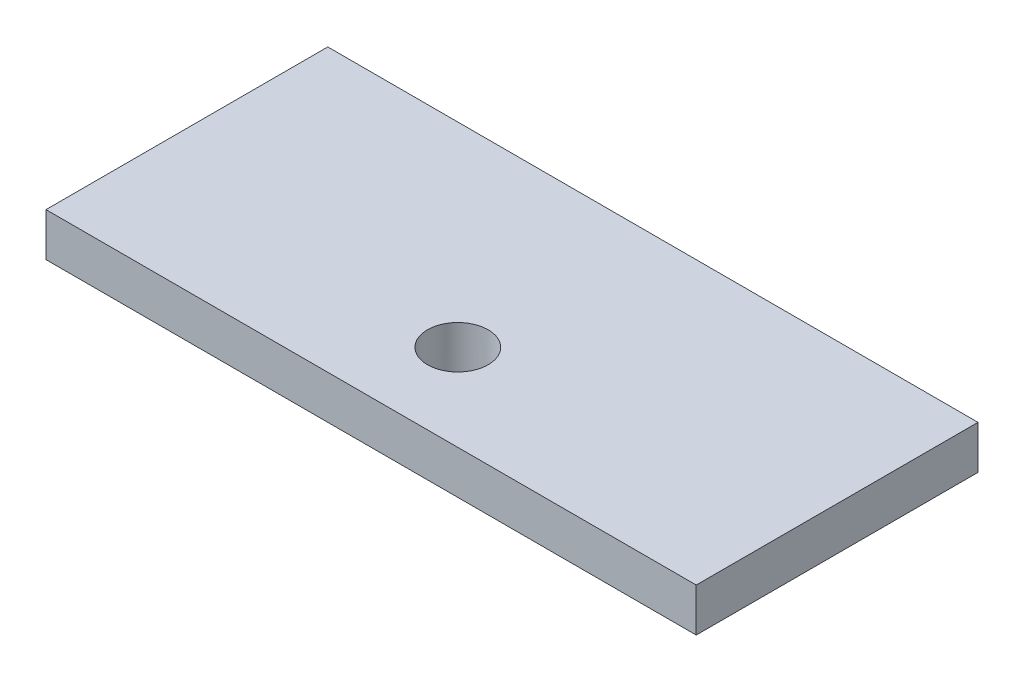
ISO-10303-21;
HEADER;
FILE_DESCRIPTION(('STEP AP214'),'2;1');
FILE_NAME('part.step','',(''),(''),'','','');
FILE_SCHEMA(('AUTOMOTIVE_DESIGN { 1 0 10303 214 1 1 1 1 }'));
ENDSEC;
DATA;
#1=APPLICATION_CONTEXT('core data for automotive mechanical design processes');
#2=APPLICATION_PROTOCOL_DEFINITION('international standard','automotive_design',2000,#1);
#3=PRODUCT_CONTEXT('',#1,'mechanical');
#4=PRODUCT('Part','Part','',(#3));
#5=PRODUCT_RELATED_PRODUCT_CATEGORY('part','',(#4));
#6=PRODUCT_DEFINITION_FORMATION('','',#4);
#7=PRODUCT_DEFINITION_CONTEXT('part definition',#1,'design');
#8=PRODUCT_DEFINITION('design','',#6,#7);
#9=PRODUCT_DEFINITION_SHAPE('','',#8);
#10=(LENGTH_UNIT() NAMED_UNIT(*) SI_UNIT(.MILLI.,.METRE.));
#11=(NAMED_UNIT(*) PLANE_ANGLE_UNIT() SI_UNIT($,.RADIAN.));
#12=(NAMED_UNIT(*) SI_UNIT($,.STERADIAN.) SOLID_ANGLE_UNIT());
#13=UNCERTAINTY_MEASURE_WITH_UNIT(LENGTH_MEASURE(1.E-05),#10,'distance_accuracy_value','');
#14=(GEOMETRIC_REPRESENTATION_CONTEXT(3) GLOBAL_UNCERTAINTY_ASSIGNED_CONTEXT((#13)) GLOBAL_UNIT_ASSIGNED_CONTEXT((#10,
#11,#12)) REPRESENTATION_CONTEXT('',''));
#15=CARTESIAN_POINT('',(0.,0.,0.));
#16=DIRECTION('',(0.,0.,1.));
#17=DIRECTION('',(1.,0.,0.));
#18=AXIS2_PLACEMENT_3D('',#15,#16,#17);
#19=CARTESIAN_POINT('',(75.,10.,32.5));
#20=DIRECTION('',(-1.,0.,0.));
#21=DIRECTION('',(0.,0.,1.));
#22=AXIS2_PLACEMENT_3D('',#19,#20,#21);
#23=PLANE('',#22);
#24=DIRECTION('',(0.,0.,-1.));
#25=VECTOR('',#24,1.);
#26=CARTESIAN_POINT('',(75.,0.,32.5));
#27=LINE('',#26,#25);
#28=CARTESIAN_POINT('',(75.,0.,32.5));
#29=VERTEX_POINT('',#28);
#30=CARTESIAN_POINT('',(75.,0.,-32.5));
#31=VERTEX_POINT('',#30);
#32=EDGE_CURVE('E100',#29,#31,#27,.T.);
#33=ORIENTED_EDGE('',*,*,#32,.T.);
#34=DIRECTION('',(0.,-1.,0.));
#35=VECTOR('',#34,1.);
#36=CARTESIAN_POINT('',(75.,10.,-32.5));
#37=LINE('',#36,#35);
#38=CARTESIAN_POINT('',(75.,10.,-32.5));
#39=VERTEX_POINT('',#38);
#40=EDGE_CURVE('E11',#39,#31,#37,.T.);
#41=ORIENTED_EDGE('',*,*,#40,.F.);
#42=DIRECTION('',(0.,0.,-1.));
#43=VECTOR('',#42,1.);
#44=CARTESIAN_POINT('',(75.,10.,32.5));
#45=LINE('',#44,#43);
#46=CARTESIAN_POINT('',(75.,10.,32.5));
#47=VERTEX_POINT('',#46);
#48=EDGE_CURVE('E87',#47,#39,#45,.T.);
#49=ORIENTED_EDGE('',*,*,#48,.F.);
#50=DIRECTION('',(0.,-1.,0.));
#51=VECTOR('',#50,1.);
#52=CARTESIAN_POINT('',(75.,10.,32.5));
#53=LINE('',#52,#51);
#54=EDGE_CURVE('E96',#47,#29,#53,.T.);
#55=ORIENTED_EDGE('',*,*,#54,.T.);
#56=EDGE_LOOP('',(#33,#41,#49,#55));
#57=FACE_BOUND('',#56,.T.);
#58=ADVANCED_FACE('F35',(#57),#23,.F.);
#59=CARTESIAN_POINT('',(-75.,10.,-32.5));
#60=DIRECTION('',(0.,0.,1.));
#61=DIRECTION('',(1.,0.,0.));
#62=AXIS2_PLACEMENT_3D('',#59,#60,#61);
#63=PLANE('',#62);
#64=DIRECTION('',(-1.,0.,0.));
#65=VECTOR('',#64,1.);
#66=CARTESIAN_POINT('',(-75.,0.,-32.5));
#67=LINE('',#66,#65);
#68=CARTESIAN_POINT('',(-75.,0.,-32.5));
#69=VERTEX_POINT('',#68);
#70=EDGE_CURVE('E91',#31,#69,#67,.T.);
#71=ORIENTED_EDGE('',*,*,#70,.T.);
#72=DIRECTION('',(0.,-1.,0.));
#73=VECTOR('',#72,1.);
#74=CARTESIAN_POINT('',(-75.,10.,-32.5));
#75=LINE('',#74,#73);
#76=CARTESIAN_POINT('',(-75.,10.,-32.5));
#77=VERTEX_POINT('',#76);
#78=EDGE_CURVE('E44',#77,#69,#75,.T.);
#79=ORIENTED_EDGE('',*,*,#78,.F.);
#80=DIRECTION('',(-1.,0.,0.));
#81=VECTOR('',#80,1.);
#82=CARTESIAN_POINT('',(-75.,10.,-32.5));
#83=LINE('',#82,#81);
#84=EDGE_CURVE('E82',#39,#77,#83,.T.);
#85=ORIENTED_EDGE('',*,*,#84,.F.);
#86=ORIENTED_EDGE('',*,*,#40,.T.);
#87=EDGE_LOOP('',(#71,#79,#85,#86));
#88=FACE_BOUND('',#87,.T.);
#89=ADVANCED_FACE('F90',(#88),#63,.F.);
#90=CARTESIAN_POINT('',(-75.,10.,32.5));
#91=DIRECTION('',(1.,0.,0.));
#92=DIRECTION('',(0.,0.,-1.));
#93=AXIS2_PLACEMENT_3D('',#90,#91,#92);
#94=PLANE('',#93);
#95=DIRECTION('',(0.,0.,1.));
#96=VECTOR('',#95,1.);
#97=CARTESIAN_POINT('',(-75.,0.,32.5));
#98=LINE('',#97,#96);
#99=CARTESIAN_POINT('',(-75.,0.,32.5));
#100=VERTEX_POINT('',#99);
#101=EDGE_CURVE('E69',#69,#100,#98,.T.);
#102=ORIENTED_EDGE('',*,*,#101,.T.);
#103=DIRECTION('',(0.,-1.,0.));
#104=VECTOR('',#103,1.);
#105=CARTESIAN_POINT('',(-75.,10.,32.5));
#106=LINE('',#105,#104);
#107=CARTESIAN_POINT('',(-75.,10.,32.5));
#108=VERTEX_POINT('',#107);
#109=EDGE_CURVE('E92',#108,#100,#106,.T.);
#110=ORIENTED_EDGE('',*,*,#109,.F.);
#111=DIRECTION('',(0.,0.,1.));
#112=VECTOR('',#111,1.);
#113=CARTESIAN_POINT('',(-75.,10.,32.5));
#114=LINE('',#113,#112);
#115=EDGE_CURVE('E85',#77,#108,#114,.T.);
#116=ORIENTED_EDGE('',*,*,#115,.F.);
#117=ORIENTED_EDGE('',*,*,#78,.T.);
#118=EDGE_LOOP('',(#102,#110,#116,#117));
#119=FACE_BOUND('',#118,.T.);
#120=ADVANCED_FACE('F94',(#119),#94,.F.);
#121=CARTESIAN_POINT('',(-75.,10.,32.5));
#122=DIRECTION('',(0.,0.,-1.));
#123=DIRECTION('',(-1.,0.,0.));
#124=AXIS2_PLACEMENT_3D('',#121,#122,#123);
#125=PLANE('',#124);
#126=DIRECTION('',(1.,0.,0.));
#127=VECTOR('',#126,1.);
#128=CARTESIAN_POINT('',(-75.,0.,32.5));
#129=LINE('',#128,#127);
#130=EDGE_CURVE('E75',#100,#29,#129,.T.);
#131=ORIENTED_EDGE('',*,*,#130,.T.);
#132=ORIENTED_EDGE('',*,*,#54,.F.);
#133=DIRECTION('',(1.,0.,0.));
#134=VECTOR('',#133,1.);
#135=CARTESIAN_POINT('',(-75.,10.,32.5));
#136=LINE('',#135,#134);
#137=EDGE_CURVE('E52',#108,#47,#136,.T.);
#138=ORIENTED_EDGE('',*,*,#137,.F.);
#139=ORIENTED_EDGE('',*,*,#109,.T.);
#140=EDGE_LOOP('',(#131,#132,#138,#139));
#141=FACE_BOUND('',#140,.T.);
#142=ADVANCED_FACE('F107',(#141),#125,.F.);
#143=CARTESIAN_POINT('',(0.,10.,0.));
#144=DIRECTION('',(0.,-1.,0.));
#145=DIRECTION('',(0.,0.,-1.));
#146=AXIS2_PLACEMENT_3D('',#143,#144,#145);
#147=PLANE('',#146);
#148=CARTESIAN_POINT('',(0.,10.,12.5));
#149=DIRECTION('',(0.,1.,0.));
#150=DIRECTION('',(0.,0.,1.));
#151=AXIS2_PLACEMENT_3D('',#148,#149,#150);
#152=CIRCLE('',#151,7.);
#153=CARTESIAN_POINT('',(0.,10.,19.5));
#154=VERTEX_POINT('',#153);
#155=EDGE_CURVE('E113',#154,#154,#152,.T.);
#156=ORIENTED_EDGE('',*,*,#155,.F.);
#157=EDGE_LOOP('',(#156));
#158=FACE_BOUND('',#157,.T.);
#159=ORIENTED_EDGE('',*,*,#48,.T.);
#160=ORIENTED_EDGE('',*,*,#84,.T.);
#161=ORIENTED_EDGE('',*,*,#115,.T.);
#162=ORIENTED_EDGE('',*,*,#137,.T.);
#163=EDGE_LOOP('',(#159,#160,#161,#162));
#164=FACE_BOUND('',#163,.T.);
#165=ADVANCED_FACE('F83',(#158,#164),#147,.F.);
#166=CARTESIAN_POINT('',(0.,0.,0.));
#167=DIRECTION('',(0.,-1.,0.));
#168=DIRECTION('',(0.,0.,-1.));
#169=AXIS2_PLACEMENT_3D('',#166,#167,#168);
#170=PLANE('',#169);
#171=CARTESIAN_POINT('',(0.,0.,12.5));
#172=DIRECTION('',(0.,-1.,0.));
#173=DIRECTION('',(0.,0.,-1.));
#174=AXIS2_PLACEMENT_3D('',#171,#172,#173);
#175=CIRCLE('',#174,7.);
#176=CARTESIAN_POINT('',(0.,0.,5.5));
#177=VERTEX_POINT('',#176);
#178=EDGE_CURVE('E38',#177,#177,#175,.T.);
#179=ORIENTED_EDGE('',*,*,#178,.F.);
#180=EDGE_LOOP('',(#179));
#181=FACE_BOUND('',#180,.T.);
#182=ORIENTED_EDGE('',*,*,#32,.F.);
#183=ORIENTED_EDGE('',*,*,#130,.F.);
#184=ORIENTED_EDGE('',*,*,#101,.F.);
#185=ORIENTED_EDGE('',*,*,#70,.F.);
#186=EDGE_LOOP('',(#182,#183,#184,#185));
#187=FACE_BOUND('',#186,.T.);
#188=ADVANCED_FACE('F110',(#181,#187),#170,.T.);
#189=CARTESIAN_POINT('',(0.,-1.2E-05,12.5));
#190=DIRECTION('',(0.,1.,0.));
#191=DIRECTION('',(0.,0.,1.));
#192=AXIS2_PLACEMENT_3D('',#189,#190,#191);
#193=CYLINDRICAL_SURFACE('',#192,7.);
#194=ORIENTED_EDGE('',*,*,#178,.T.);
#195=EDGE_LOOP('',(#194));
#196=FACE_BOUND('',#195,.T.);
#197=ORIENTED_EDGE('',*,*,#155,.T.);
#198=EDGE_LOOP('',(#197));
#199=FACE_BOUND('',#198,.T.);
#200=ADVANCED_FACE('F120',(#196,#199),#193,.F.);
#201=CLOSED_SHELL('',(#58,#89,#120,#142,#165,#188,#200));
#202=MANIFOLD_SOLID_BREP('B2',#201);
#203=ADVANCED_BREP_SHAPE_REPRESENTATION('',(#18,#202),#14);
#204=SHAPE_DEFINITION_REPRESENTATION(#9,#203);
ENDSEC;
END-ISO-10303-21;
